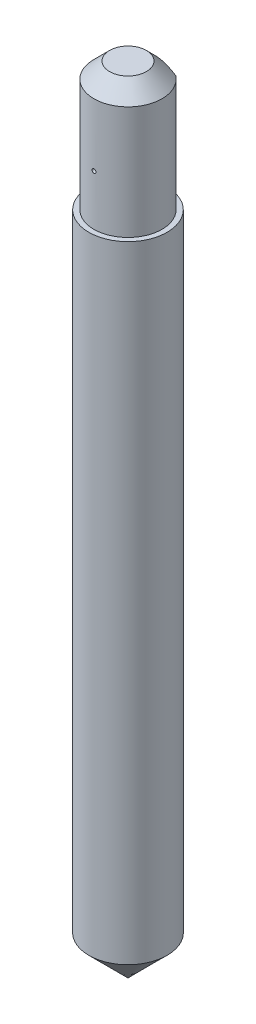
ISO-10303-21;
HEADER;
FILE_DESCRIPTION(('STEP AP214'),'2;1');
FILE_NAME('part.step','',(''),(''),'','','');
FILE_SCHEMA(('AUTOMOTIVE_DESIGN { 1 0 10303 214 1 1 1 1 }'));
ENDSEC;
DATA;
#1=APPLICATION_CONTEXT('core data for automotive mechanical design processes');
#2=APPLICATION_PROTOCOL_DEFINITION('international standard','automotive_design',2000,#1);
#3=PRODUCT_CONTEXT('',#1,'mechanical');
#4=PRODUCT('Part','Part','',(#3));
#5=PRODUCT_RELATED_PRODUCT_CATEGORY('part','',(#4));
#6=PRODUCT_DEFINITION_FORMATION('','',#4);
#7=PRODUCT_DEFINITION_CONTEXT('part definition',#1,'design');
#8=PRODUCT_DEFINITION('design','',#6,#7);
#9=PRODUCT_DEFINITION_SHAPE('','',#8);
#10=(LENGTH_UNIT() NAMED_UNIT(*) SI_UNIT(.MILLI.,.METRE.));
#11=(NAMED_UNIT(*) PLANE_ANGLE_UNIT() SI_UNIT($,.RADIAN.));
#12=(NAMED_UNIT(*) SI_UNIT($,.STERADIAN.) SOLID_ANGLE_UNIT());
#13=UNCERTAINTY_MEASURE_WITH_UNIT(LENGTH_MEASURE(1.E-05),#10,'distance_accuracy_value','');
#14=(GEOMETRIC_REPRESENTATION_CONTEXT(3) GLOBAL_UNCERTAINTY_ASSIGNED_CONTEXT((#13)) GLOBAL_UNIT_ASSIGNED_CONTEXT((#10,
#11,#12)) REPRESENTATION_CONTEXT('',''));
#15=CARTESIAN_POINT('',(0.,0.,0.));
#16=DIRECTION('',(0.,0.,1.));
#17=DIRECTION('',(1.,0.,0.));
#18=AXIS2_PLACEMENT_3D('',#15,#16,#17);
#19=CARTESIAN_POINT('',(0.,85.,0.));
#20=DIRECTION('',(0.,-1.,0.));
#21=DIRECTION('',(0.,0.,-1.));
#22=AXIS2_PLACEMENT_3D('',#19,#20,#21);
#23=CYLINDRICAL_SURFACE('',#22,5.);
#24=CARTESIAN_POINT('',(0.,5.00000000000002,0.));
#25=DIRECTION('',(0.,1.,0.));
#26=DIRECTION('',(0.,0.,1.));
#27=AXIS2_PLACEMENT_3D('',#24,#25,#26);
#28=CIRCLE('',#27,5.);
#29=CARTESIAN_POINT('',(0.,5.00000000000002,5.));
#30=VERTEX_POINT('',#29);
#31=EDGE_CURVE('E113',#30,#30,#28,.T.);
#32=ORIENTED_EDGE('',*,*,#31,.T.);
#33=EDGE_LOOP('',(#32));
#34=FACE_BOUND('',#33,.T.);
#35=CARTESIAN_POINT('',(0.,85.,0.));
#36=DIRECTION('',(0.,1.,0.));
#37=DIRECTION('',(0.,0.,1.));
#38=AXIS2_PLACEMENT_3D('',#35,#36,#37);
#39=CIRCLE('',#38,5.);
#40=CARTESIAN_POINT('',(0.,85.,5.));
#41=VERTEX_POINT('',#40);
#42=EDGE_CURVE('E109',#41,#41,#39,.T.);
#43=ORIENTED_EDGE('',*,*,#42,.F.);
#44=EDGE_LOOP('',(#43));
#45=FACE_BOUND('',#44,.T.);
#46=ADVANCED_FACE('F45',(#34,#45),#23,.T.);
#47=CARTESIAN_POINT('',(0.,85.,0.));
#48=DIRECTION('',(0.,1.,0.));
#49=DIRECTION('',(0.,0.,1.));
#50=AXIS2_PLACEMENT_3D('',#47,#48,#49);
#51=PLANE('',#50);
#52=CARTESIAN_POINT('',(0.,85.,0.));
#53=DIRECTION('',(0.,1.,0.));
#54=DIRECTION('',(0.,0.,1.));
#55=AXIS2_PLACEMENT_3D('',#52,#53,#54);
#56=CIRCLE('',#55,4.35);
#57=CARTESIAN_POINT('',(-2.64952825989835,85.,-3.45));
#58=VERTEX_POINT('',#57);
#59=CARTESIAN_POINT('',(2.64952825989835,85.,-3.45));
#60=VERTEX_POINT('',#59);
#61=EDGE_CURVE('E90',#58,#60,#56,.T.);
#62=ORIENTED_EDGE('',*,*,#61,.F.);
#63=DIRECTION('',(-1.,0.,0.));
#64=VECTOR('',#63,1.);
#65=CARTESIAN_POINT('',(-2.64952825989835,85.,-3.45));
#66=LINE('',#65,#64);
#67=EDGE_CURVE('E95',#60,#58,#66,.T.);
#68=ORIENTED_EDGE('',*,*,#67,.F.);
#69=EDGE_LOOP('',(#62,#68));
#70=FACE_BOUND('',#69,.T.);
#71=ORIENTED_EDGE('',*,*,#42,.T.);
#72=EDGE_LOOP('',(#71));
#73=FACE_BOUND('',#72,.T.);
#74=ADVANCED_FACE('F99',(#70,#73),#51,.T.);
#75=CARTESIAN_POINT('',(0.,5.00000000000002,0.));
#76=DIRECTION('',(0.,1.,0.));
#77=DIRECTION('',(0.,0.,1.));
#78=AXIS2_PLACEMENT_3D('',#75,#76,#77);
#79=CONICAL_SURFACE('',#78,5.00000000000003,0.785398163397449);
#80=CARTESIAN_POINT('',(0.,0.,0.));
#81=VERTEX_POINT('',#80);
#82=VERTEX_LOOP('',#81);
#83=FACE_BOUND('',#82,.T.);
#84=ORIENTED_EDGE('',*,*,#31,.F.);
#85=EDGE_LOOP('',(#84));
#86=FACE_BOUND('',#85,.T.);
#87=ADVANCED_FACE('F132',(#83,#86),#79,.T.);
#88=CARTESIAN_POINT('',(0.,101.45,0.));
#89=DIRECTION('',(0.,-1.,0.));
#90=DIRECTION('',(0.,0.,-1.));
#91=AXIS2_PLACEMENT_3D('',#88,#89,#90);
#92=CYLINDRICAL_SURFACE('',#91,4.35);
#93=CARTESIAN_POINT('',(-0.249896761614383,91.45,4.34281609195402));
#94=CARTESIAN_POINT('',(-0.249896149390698,91.4640397511877,4.34281618796565));
#95=CARTESIAN_POINT('',(-0.248711620429201,91.4780893757712,4.34288479067828));
#96=CARTESIAN_POINT('',(-0.244002691512361,91.5058012216067,4.34315185488969));
#97=CARTESIAN_POINT('',(-0.240475557208031,91.519462970666,4.34335046813618));
#98=CARTESIAN_POINT('',(-0.231181404570376,91.5459940079172,4.34385504978031));
#99=CARTESIAN_POINT('',(-0.225415452828085,91.5588636700886,4.34416096705073));
#100=CARTESIAN_POINT('',(-0.211807910147596,91.5834478568105,4.34484563503009));
#101=CARTESIAN_POINT('',(-0.203966814459503,91.5951626560642,4.34522436835499));
#102=CARTESIAN_POINT('',(-0.186427108485392,91.6171125217822,4.34601217110204));
#103=CARTESIAN_POINT('',(-0.176727928291196,91.6273471325513,4.346421249808));
#104=CARTESIAN_POINT('',(-0.155747470355393,91.646042370348,4.34722356174669));
#105=CARTESIAN_POINT('',(-0.144466133490059,91.6545029310515,4.34761679438655));
#106=CARTESIAN_POINT('',(-0.120642885237084,91.6694084808586,4.34834302660246));
#107=CARTESIAN_POINT('',(-0.108101157323509,91.6758537627646,4.3486760349256));
#108=CARTESIAN_POINT('',(-0.0821116143527737,91.6865473366302,4.34924435454291));
#109=CARTESIAN_POINT('',(-0.068663805169936,91.6907956428316,4.34947966647039));
#110=CARTESIAN_POINT('',(-0.0412551562079586,91.6969720681251,4.34982592778283));
#111=CARTESIAN_POINT('',(-0.0272947301095854,91.6989020174869,4.34993697526591));
#112=CARTESIAN_POINT('',(0.000752416712592463,91.7003929894767,4.35002253645602));
#113=CARTESIAN_POINT('',(0.0148391366669899,91.6999540265268,4.34999705099426));
#114=CARTESIAN_POINT('',(0.042729663862396,91.6967207131197,4.34981247756496));
#115=CARTESIAN_POINT('',(0.0565336437556033,91.6939278468037,4.34965347378125));
#116=CARTESIAN_POINT('',(0.0834762838073477,91.6860679352748,4.34921985672585));
#117=CARTESIAN_POINT('',(0.0966149424619463,91.6810008849215,4.34894524319285));
#118=CARTESIAN_POINT('',(0.121858678456932,91.6687343146831,4.34831117921379));
#119=CARTESIAN_POINT('',(0.133963435277216,91.6615341365758,4.34795170258837));
#120=CARTESIAN_POINT('',(0.156792482244323,91.6452058019577,4.34718837658969));
#121=CARTESIAN_POINT('',(0.167516766175815,91.636077636767,4.34678452701666));
#122=CARTESIAN_POINT('',(0.187290569834294,91.6161429848385,4.34597750554787));
#123=CARTESIAN_POINT('',(0.196338641679903,91.6053350618366,4.34557433453333));
#124=CARTESIAN_POINT('',(0.21249302208013,91.5823527805055,4.34481441804321));
#125=CARTESIAN_POINT('',(0.219599325483806,91.5701784185515,4.34445767269079));
#126=CARTESIAN_POINT('',(0.231672056906116,91.5448029208752,4.34383065928801));
#127=CARTESIAN_POINT('',(0.236637588543959,91.5316013577706,4.34356042747463));
#128=CARTESIAN_POINT('',(0.2442841139258,91.5045506194996,4.34313712201884));
#129=CARTESIAN_POINT('',(0.246965110883894,91.4907014452444,4.34298404821159));
#130=CARTESIAN_POINT('',(0.249966464397896,91.4627519652481,4.34281234644706));
#131=CARTESIAN_POINT('',(0.250287353759705,91.4486517169087,4.34279368814484));
#132=CARTESIAN_POINT('',(0.248560831452664,91.4205974670604,4.34289284133658));
#133=CARTESIAN_POINT('',(0.246513421777098,91.4066434654284,4.34301065271567));
#134=CARTESIAN_POINT('',(0.240108673381511,91.3792800937351,4.34336942972019));
#135=CARTESIAN_POINT('',(0.235751705404483,91.3658706366324,4.34361037557917));
#136=CARTESIAN_POINT('',(0.224851095082787,91.3399743047282,4.34418825586013));
#137=CARTESIAN_POINT('',(0.218307448640361,91.3274874316556,4.344525190462));
#138=CARTESIAN_POINT('',(0.20321624114163,91.3037870965915,4.34525718764405));
#139=CARTESIAN_POINT('',(0.194668155036537,91.2925739693932,4.34565226544431));
#140=CARTESIAN_POINT('',(0.175810532582727,91.2717427542274,4.34645596801573));
#141=CARTESIAN_POINT('',(0.165500993499493,91.2621246687362,4.34686459280793));
#142=CARTESIAN_POINT('',(0.143411146815907,91.2447555109615,4.34764938380554));
#143=CARTESIAN_POINT('',(0.131630713846307,91.2370045979884,4.34802554723953));
#144=CARTESIAN_POINT('',(0.106933668590119,91.223590881223,4.34870297764284));
#145=CARTESIAN_POINT('',(0.0940170614445877,91.2179280679828,4.34900424495102));
#146=CARTESIAN_POINT('',(0.0674228297200497,91.208854310162,4.34949776181964));
#147=CARTESIAN_POINT('',(0.0537456891795521,91.2054419506797,4.34969007986774));
#148=CARTESIAN_POINT('',(0.0260115731232719,91.2009603938689,4.34994432504368));
#149=CARTESIAN_POINT('',(0.0119545989038952,91.1998911885441,4.35000625261651));
#150=CARTESIAN_POINT('',(-0.0161280869359138,91.200126229638,4.34999274635543));
#151=CARTESIAN_POINT('',(-0.0301538145964175,91.2014285707912,4.34991742278703));
#152=CARTESIAN_POINT('',(-0.0577871541037257,91.2063659959946,4.34963810528637));
#153=CARTESIAN_POINT('',(-0.071394765461724,91.2100010827718,4.34943411120367));
#154=CARTESIAN_POINT('',(-0.0978060200687271,91.2195008975491,4.34892039376901));
#155=CARTESIAN_POINT('',(-0.110609656247001,91.2253656451553,4.34861066948732));
#156=CARTESIAN_POINT('',(-0.13504994453893,91.2391583778303,4.34792032629677));
#157=CARTESIAN_POINT('',(-0.146686635725223,91.2470862937865,4.34753970976279));
#158=CARTESIAN_POINT('',(-0.168472321102323,91.2647871476513,4.34675007332515));
#159=CARTESIAN_POINT('',(-0.17862028071826,91.2745613579286,4.34634103395759));
#160=CARTESIAN_POINT('',(-0.197134554843588,91.2956775201709,4.3455407130348));
#161=CARTESIAN_POINT('',(-0.205500433172713,91.3070198548306,4.34514943584541));
#162=CARTESIAN_POINT('',(-0.220219191953587,91.3309607193439,4.34442839056546));
#163=CARTESIAN_POINT('',(-0.22656984104349,91.343560621495,4.34409869082147));
#164=CARTESIAN_POINT('',(-0.237060444333481,91.3696396724817,4.34353890287813));
#165=CARTESIAN_POINT('',(-0.241202973304581,91.3831177766124,4.34330869872182));
#166=CARTESIAN_POINT('',(-0.246083286216587,91.405565168003,4.34303423574308));
#167=CARTESIAN_POINT('',(-0.247511523977949,91.414389935858,4.34295279417798));
#168=CARTESIAN_POINT('',(-0.24941845635079,91.4321418040256,4.34284369174854));
#169=CARTESIAN_POINT('',(-0.249897151067746,91.4410689043269,4.34281603087822));
#170=CARTESIAN_POINT('',(-0.249896761614383,91.45,4.34281609195402));
#171=B_SPLINE_CURVE_WITH_KNOTS('',3,(#93,#94,#95,#96,#97,#98,#99,#100,#101,#102,#103,#104,#105,
#106,#107,#108,#109,#110,#111,#112,#113,#114,#115,#116,#117,#118,#119,#120,#121,#122,#123,#124,
#125,#126,#127,#128,#129,#130,#131,#132,#133,#134,#135,#136,#137,#138,#139,#140,#141,#142,#143,
#144,#145,#146,#147,#148,#149,#150,#151,#152,#153,#154,#155,#156,#157,#158,#159,#160,#161,#162,
#163,#164,#165,#166,#167,#168,#169,#170),.UNSPECIFIED.,.T.,.F.,(4,2,2,2,2,2,2,2,2,2,2,2,2,2,2,2,
2,2,2,2,2,2,2,2,2,2,2,2,2,2,2,2,2,2,2,2,2,2,4),(0.,0.0420866832346794,0.0842225776608293,
0.126338422781788,0.168444225661238,0.210562963890436,0.252683276477425,0.294797466502922,
0.336911383519192,0.378992031028337,0.421072422347777,0.463126301718049,0.505180276145595,
0.547247240769524,0.589314394785802,0.631417717920588,0.673521152742092,0.715642199969838,
0.75776318793767,0.799874666593297,0.841986109805745,0.884090795104094,0.926195559305601,
0.968311364896817,1.0104272358701,1.05254669897472,1.09466597150345,1.13675873755988,
1.17885135996813,1.22091018070272,1.26296905060505,1.30502829035128,1.34708612136397,
1.38917304286374,1.43127025370627,1.47341391532829,1.51550832737649,1.54228089843289,
1.56905346651539),.UNSPECIFIED.);
#172=CARTESIAN_POINT('',(-0.249896761614383,91.45,4.34281609195402));
#173=VERTEX_POINT('',#172);
#174=EDGE_CURVE('E51',#173,#173,#171,.T.);
#175=ORIENTED_EDGE('',*,*,#174,.T.);
#176=EDGE_LOOP('',(#175));
#177=FACE_BOUND('',#176,.T.);
#178=DIRECTION('',(0.,-1.,0.));
#179=VECTOR('',#178,1.);
#180=CARTESIAN_POINT('',(2.64952825989835,101.45,-3.45));
#181=LINE('',#180,#179);
#182=CARTESIAN_POINT('',(2.64952825989835,99.45,-3.45));
#183=VERTEX_POINT('',#182);
#184=EDGE_CURVE('E94',#183,#60,#181,.T.);
#185=ORIENTED_EDGE('',*,*,#184,.F.);
#186=CARTESIAN_POINT('',(0.,99.45,0.));
#187=DIRECTION('',(0.,1.,0.));
#188=DIRECTION('',(0.,0.,1.));
#189=AXIS2_PLACEMENT_3D('',#186,#187,#188);
#190=CIRCLE('',#189,4.35);
#191=CARTESIAN_POINT('',(-2.64952825989835,99.45,-3.45));
#192=VERTEX_POINT('',#191);
#193=EDGE_CURVE('E62',#183,#192,#190,.F.);
#194=ORIENTED_EDGE('',*,*,#193,.T.);
#195=DIRECTION('',(0.,-1.,0.));
#196=VECTOR('',#195,1.);
#197=CARTESIAN_POINT('',(-2.64952825989835,101.45,-3.45));
#198=LINE('',#197,#196);
#199=EDGE_CURVE('E86',#192,#58,#198,.T.);
#200=ORIENTED_EDGE('',*,*,#199,.T.);
#201=ORIENTED_EDGE('',*,*,#61,.T.);
#202=EDGE_LOOP('',(#185,#194,#200,#201));
#203=FACE_BOUND('',#202,.T.);
#204=ADVANCED_FACE('F89',(#177,#203),#92,.T.);
#205=CARTESIAN_POINT('',(-2.64952825989835,101.45,-3.45));
#206=DIRECTION('',(0.,0.,1.));
#207=DIRECTION('',(1.,0.,0.));
#208=AXIS2_PLACEMENT_3D('',#205,#206,#207);
#209=PLANE('',#208);
#210=ORIENTED_EDGE('',*,*,#199,.F.);
#211=CARTESIAN_POINT('',(-2.64952825989835,99.45,-3.45));
#212=CARTESIAN_POINT('',(-2.58551376141363,99.4889862603996,-3.45));
#213=CARTESIAN_POINT('',(-2.52110873290686,99.5273302946292,-3.45));
#214=CARTESIAN_POINT('',(-2.39142545385021,99.6025462037917,-3.45));
#215=CARTESIAN_POINT('',(-2.32614700232432,99.6394177318418,-3.45));
#216=CARTESIAN_POINT('',(-2.12841526055793,99.7477851368602,-3.45));
#217=CARTESIAN_POINT('',(-1.99454470182278,99.8167383202574,-3.45));
#218=CARTESIAN_POINT('',(-1.71970925214949,99.9470842842519,-3.45));
#219=CARTESIAN_POINT('',(-1.57865475143995,100.00829021249,-3.45));
#220=CARTESIAN_POINT('',(-1.29194831268462,100.118399827086,-3.45));
#221=CARTESIAN_POINT('',(-1.14630374015561,100.167322195591,-3.45));
#222=CARTESIAN_POINT('',(-0.897832931710079,100.236398187679,-3.45));
#223=CARTESIAN_POINT('',(-0.796175772654603,100.260750300258,-3.45));
#224=CARTESIAN_POINT('',(-0.591195746959349,100.301153385201,-3.45));
#225=CARTESIAN_POINT('',(-0.487872881016845,100.317204361038,-3.45));
#226=CARTESIAN_POINT('',(-0.281317092231042,100.340054689785,-3.45));
#227=CARTESIAN_POINT('',(-0.178095081097089,100.346951384763,-3.45));
#228=CARTESIAN_POINT('',(0.0285512585002764,100.351428272541,-3.45));
#229=CARTESIAN_POINT('',(0.131975579925753,100.349008783867,-3.45));
#230=CARTESIAN_POINT('',(0.337884877217168,100.335011980705,-3.45));
#231=CARTESIAN_POINT('',(0.440371726496268,100.323461769725,-3.45));
#232=CARTESIAN_POINT('',(0.644028602079317,100.291846106228,-3.45));
#233=CARTESIAN_POINT('',(0.745198306069886,100.271778608399,-3.45));
#234=CARTESIAN_POINT('',(0.947095389308099,100.223725918136,-3.45));
#235=CARTESIAN_POINT('',(1.04779733104747,100.195635131502,-3.45));
#236=CARTESIAN_POINT('',(1.2470402981069,100.132757086528,-3.45));
#237=CARTESIAN_POINT('',(1.3455817279456,100.097971093885,-3.45));
#238=CARTESIAN_POINT('',(1.57513795049771,100.009394269198,-3.45));
#239=CARTESIAN_POINT('',(1.70523858162849,99.953244203562,-3.45));
#240=CARTESIAN_POINT('',(1.96169182403142,99.8328976848776,-3.45));
#241=CARTESIAN_POINT('',(2.0880422742729,99.7686966997158,-3.45));
#242=CARTESIAN_POINT('',(2.3378299032368,99.6338436692577,-3.45));
#243=CARTESIAN_POINT('',(2.46125456394065,99.5631686197021,-3.45));
#244=CARTESIAN_POINT('',(2.70515277588358,99.4169842355628,-3.45));
#245=CARTESIAN_POINT('',(2.82562691143764,99.3414758690379,-3.45));
#246=CARTESIAN_POINT('',(3.05764415265085,99.1908423034958,-3.45));
#247=CARTESIAN_POINT('',(3.16931788489006,99.1159172546372,-3.45));
#248=CARTESIAN_POINT('',(3.39078076531299,98.963321520597,-3.45));
#249=CARTESIAN_POINT('',(3.50056976237461,98.8856506167604,-3.45));
#250=CARTESIAN_POINT('',(3.71756486920894,98.7287864387467,-3.45));
#251=CARTESIAN_POINT('',(3.82478527044261,98.6496128666735,-3.45));
#252=CARTESIAN_POINT('',(4.03783427823602,98.4894700547887,-3.45));
#253=CARTESIAN_POINT('',(4.14366324105536,98.4085012894594,-3.45));
#254=CARTESIAN_POINT('',(4.24892067683448,98.3268083426549,-3.45));
#255=B_SPLINE_CURVE_WITH_KNOTS('',3,(#211,#212,#213,#214,#215,#216,#217,#218,#219,#220,#221,
#222,#223,#224,#225,#226,#227,#228,#229,#230,#231,#232,#233,#234,#235,#236,#237,#238,#239,#240,
#241,#242,#243,#244,#245,#246,#247,#248,#249,#250,#251,#252,#253,#254),.UNSPECIFIED.,.F.,.F.,(4,
2,2,2,2,2,2,2,2,2,2,2,2,2,2,2,2,2,2,2,2,4),(0.,0.224848244282895,0.449749148025135,
0.901237996373357,1.36210759752319,1.82227195425988,2.1355778831272,2.44888368084637,
2.75883051597511,3.06876675395763,3.37778642063154,3.6868803363182,4.00024611466198,
4.3135527107695,4.7382793924787,5.16324624846141,5.58978649507649,6.01624157621428,
6.41963196225413,6.82305454333323,7.22288656683182,7.62261414283473),.UNSPECIFIED.);
#256=EDGE_CURVE('E11',#192,#183,#255,.T.);
#257=ORIENTED_EDGE('',*,*,#256,.T.);
#258=ORIENTED_EDGE('',*,*,#184,.T.);
#259=ORIENTED_EDGE('',*,*,#67,.T.);
#260=EDGE_LOOP('',(#210,#257,#258,#259));
#261=FACE_BOUND('',#260,.T.);
#262=ADVANCED_FACE('F103',(#261),#209,.F.);
#263=CARTESIAN_POINT('',(0.,101.45,0.));
#264=DIRECTION('',(0.,1.,0.));
#265=DIRECTION('',(0.,0.,1.));
#266=AXIS2_PLACEMENT_3D('',#263,#264,#265);
#267=PLANE('',#266);
#268=CARTESIAN_POINT('',(0.,101.45,0.));
#269=DIRECTION('',(0.,1.,0.));
#270=DIRECTION('',(0.,0.,1.));
#271=AXIS2_PLACEMENT_3D('',#268,#269,#270);
#272=CIRCLE('',#271,2.35);
#273=CARTESIAN_POINT('',(-1.43135434730141,101.45,-1.86379310344828));
#274=VERTEX_POINT('',#273);
#275=EDGE_CURVE('E67',#274,#274,#272,.T.);
#276=ORIENTED_EDGE('',*,*,#275,.T.);
#277=EDGE_LOOP('',(#276));
#278=FACE_BOUND('',#277,.T.);
#279=ADVANCED_FACE('F128',(#278),#267,.T.);
#280=CARTESIAN_POINT('',(0.,101.45,0.));
#281=DIRECTION('',(0.,-1.,0.));
#282=DIRECTION('',(0.,0.,-1.));
#283=AXIS2_PLACEMENT_3D('',#280,#281,#282);
#284=CONICAL_SURFACE('',#283,2.35,0.785398163397443);
#285=ORIENTED_EDGE('',*,*,#256,.F.);
#286=ORIENTED_EDGE('',*,*,#193,.F.);
#287=EDGE_LOOP('',(#285,#286));
#288=FACE_BOUND('',#287,.T.);
#289=ORIENTED_EDGE('',*,*,#275,.F.);
#290=EDGE_LOOP('',(#289));
#291=FACE_BOUND('',#290,.T.);
#292=ADVANCED_FACE('F48',(#288,#291),#284,.T.);
#293=CARTESIAN_POINT('',(0.,91.45,4.35));
#294=DIRECTION('',(0.,-1.,0.));
#295=DIRECTION('',(0.,0.,1.));
#296=AXIS2_PLACEMENT_3D('',#293,#294,#295);
#297=SPHERICAL_SURFACE('',#296,0.25);
#298=ORIENTED_EDGE('',*,*,#174,.F.);
#299=EDGE_LOOP('',(#298));
#300=FACE_BOUND('',#299,.T.);
#301=ADVANCED_FACE('F173',(#300),#297,.F.);
#302=CLOSED_SHELL('',(#46,#74,#87,#204,#262,#279,#292,#301));
#303=MANIFOLD_SOLID_BREP('B2',#302);
#304=ADVANCED_BREP_SHAPE_REPRESENTATION('',(#18,#303),#14);
#305=SHAPE_DEFINITION_REPRESENTATION(#9,#304);
ENDSEC;
END-ISO-10303-21;
